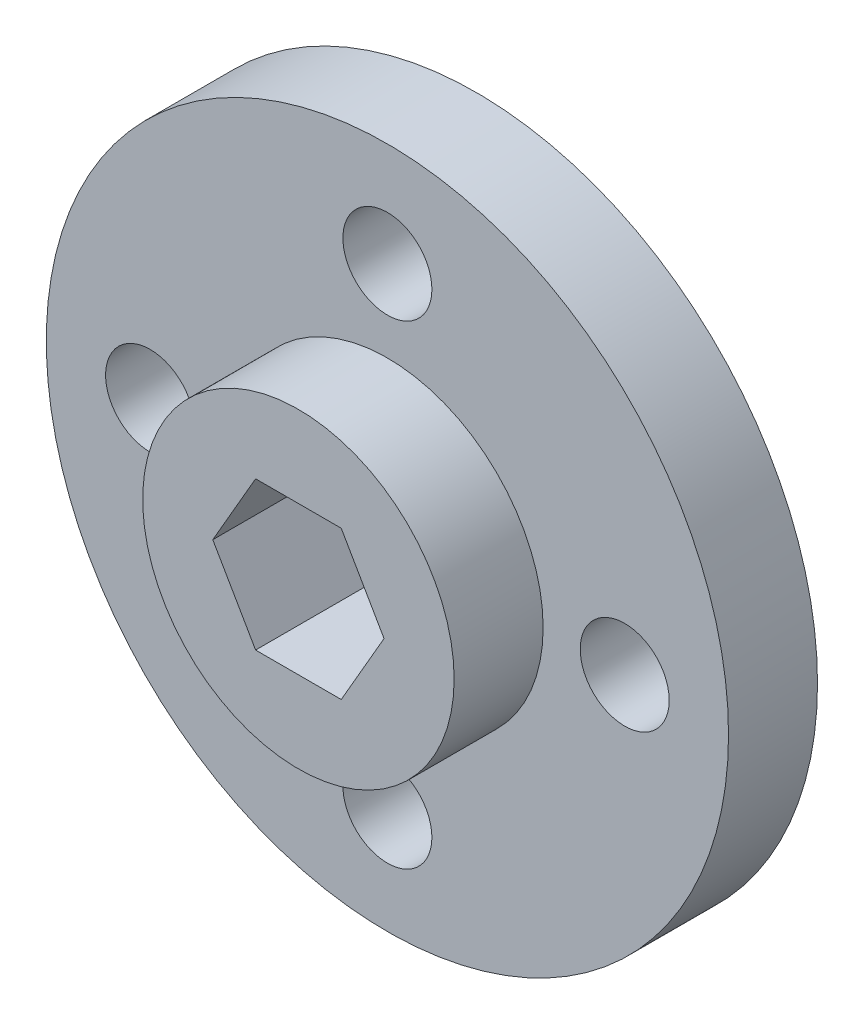
ISO-10303-21;
HEADER;
FILE_DESCRIPTION(('STEP AP214'),'2;1');
FILE_NAME('part.step','',(''),(''),'','','');
FILE_SCHEMA(('AUTOMOTIVE_DESIGN { 1 0 10303 214 1 1 1 1 }'));
ENDSEC;
DATA;
#1=APPLICATION_CONTEXT('core data for automotive mechanical design processes');
#2=APPLICATION_PROTOCOL_DEFINITION('international standard','automotive_design',2000,#1);
#3=PRODUCT_CONTEXT('',#1,'mechanical');
#4=PRODUCT('Part','Part','',(#3));
#5=PRODUCT_RELATED_PRODUCT_CATEGORY('part','',(#4));
#6=PRODUCT_DEFINITION_FORMATION('','',#4);
#7=PRODUCT_DEFINITION_CONTEXT('part definition',#1,'design');
#8=PRODUCT_DEFINITION('design','',#6,#7);
#9=PRODUCT_DEFINITION_SHAPE('','',#8);
#10=(LENGTH_UNIT() NAMED_UNIT(*) SI_UNIT(.MILLI.,.METRE.));
#11=(NAMED_UNIT(*) PLANE_ANGLE_UNIT() SI_UNIT($,.RADIAN.));
#12=(NAMED_UNIT(*) SI_UNIT($,.STERADIAN.) SOLID_ANGLE_UNIT());
#13=UNCERTAINTY_MEASURE_WITH_UNIT(LENGTH_MEASURE(1.E-05),#10,'distance_accuracy_value','');
#14=(GEOMETRIC_REPRESENTATION_CONTEXT(3) GLOBAL_UNCERTAINTY_ASSIGNED_CONTEXT((#13)) GLOBAL_UNIT_ASSIGNED_CONTEXT((#10,
#11,#12)) REPRESENTATION_CONTEXT('',''));
#15=CARTESIAN_POINT('',(0.,0.,0.));
#16=DIRECTION('',(0.,0.,1.));
#17=DIRECTION('',(1.,0.,0.));
#18=AXIS2_PLACEMENT_3D('',#15,#16,#17);
#19=CARTESIAN_POINT('',(0.,0.,3.));
#20=DIRECTION('',(0.,0.,1.));
#21=DIRECTION('',(1.,0.,0.));
#22=AXIS2_PLACEMENT_3D('',#19,#20,#21);
#23=PLANE('',#22);
#24=CARTESIAN_POINT('',(0.,0.,3.));
#25=DIRECTION('',(0.,0.,1.));
#26=DIRECTION('',(1.,0.,0.));
#27=AXIS2_PLACEMENT_3D('',#24,#25,#26);
#28=CIRCLE('',#27,5.25);
#29=CARTESIAN_POINT('',(5.25,0.,3.));
#30=VERTEX_POINT('',#29);
#31=EDGE_CURVE('E136',#30,#30,#28,.T.);
#32=ORIENTED_EDGE('',*,*,#31,.F.);
#33=EDGE_LOOP('',(#32));
#34=FACE_BOUND('',#33,.T.);
#35=CARTESIAN_POINT('',(2.29241571302247E-13,-7.99999999999977,3.));
#36=DIRECTION('',(0.,0.,1.));
#37=DIRECTION('',(1.,0.,0.));
#38=AXIS2_PLACEMENT_3D('',#35,#36,#37);
#39=CIRCLE('',#38,1.50000000000034);
#40=CARTESIAN_POINT('',(1.50000000000057,-7.99999999999977,3.));
#41=VERTEX_POINT('',#40);
#42=EDGE_CURVE('E154',#41,#41,#39,.T.);
#43=ORIENTED_EDGE('',*,*,#42,.F.);
#44=EDGE_LOOP('',(#43));
#45=FACE_BOUND('',#44,.T.);
#46=CARTESIAN_POINT('',(0.,8.,3.));
#47=DIRECTION('',(0.,0.,1.));
#48=DIRECTION('',(1.,0.,0.));
#49=AXIS2_PLACEMENT_3D('',#46,#47,#48);
#50=CIRCLE('',#49,1.5);
#51=CARTESIAN_POINT('',(1.5,8.,3.));
#52=VERTEX_POINT('',#51);
#53=EDGE_CURVE('E166',#52,#52,#50,.T.);
#54=ORIENTED_EDGE('',*,*,#53,.F.);
#55=EDGE_LOOP('',(#54));
#56=FACE_BOUND('',#55,.T.);
#57=CARTESIAN_POINT('',(0.,0.,3.));
#58=DIRECTION('',(0.,0.,1.));
#59=DIRECTION('',(1.,0.,0.));
#60=AXIS2_PLACEMENT_3D('',#57,#58,#59);
#61=CIRCLE('',#60,11.5);
#62=CARTESIAN_POINT('',(11.5,0.,3.));
#63=VERTEX_POINT('',#62);
#64=EDGE_CURVE('E11',#63,#63,#61,.T.);
#65=ORIENTED_EDGE('',*,*,#64,.T.);
#66=EDGE_LOOP('',(#65));
#67=FACE_BOUND('',#66,.T.);
#68=CARTESIAN_POINT('',(8.00000000000023,2.25904099284255E-13,3.));
#69=DIRECTION('',(0.,0.,1.));
#70=DIRECTION('',(1.,0.,0.));
#71=AXIS2_PLACEMENT_3D('',#68,#69,#70);
#72=CIRCLE('',#71,1.50000000000018);
#73=CARTESIAN_POINT('',(9.5000000000004,2.25904099284255E-13,3.));
#74=VERTEX_POINT('',#73);
#75=EDGE_CURVE('E160',#74,#74,#72,.T.);
#76=ORIENTED_EDGE('',*,*,#75,.F.);
#77=EDGE_LOOP('',(#76));
#78=FACE_BOUND('',#77,.T.);
#79=CARTESIAN_POINT('',(-7.99999999999977,-2.26883816723573E-13,3.));
#80=DIRECTION('',(0.,0.,1.));
#81=DIRECTION('',(1.,0.,0.));
#82=AXIS2_PLACEMENT_3D('',#79,#80,#81);
#83=CIRCLE('',#82,1.50000000000036);
#84=CARTESIAN_POINT('',(-6.49999999999941,-2.26883816723573E-13,3.));
#85=VERTEX_POINT('',#84);
#86=EDGE_CURVE('E148',#85,#85,#83,.T.);
#87=ORIENTED_EDGE('',*,*,#86,.F.);
#88=EDGE_LOOP('',(#87));
#89=FACE_BOUND('',#88,.T.);
#90=ADVANCED_FACE('F33',(#34,#45,#56,#67,#78,#89),#23,.T.);
#91=CARTESIAN_POINT('',(0.,0.,0.));
#92=DIRECTION('',(0.,0.,1.));
#93=DIRECTION('',(1.,0.,0.));
#94=AXIS2_PLACEMENT_3D('',#91,#92,#93);
#95=PLANE('',#94);
#96=CARTESIAN_POINT('',(0.,0.,0.));
#97=DIRECTION('',(0.,0.,1.));
#98=DIRECTION('',(1.,0.,0.));
#99=AXIS2_PLACEMENT_3D('',#96,#97,#98);
#100=CIRCLE('',#99,1.65);
#101=CARTESIAN_POINT('',(1.65,0.,0.));
#102=VERTEX_POINT('',#101);
#103=EDGE_CURVE('E123',#102,#102,#100,.F.);
#104=ORIENTED_EDGE('',*,*,#103,.F.);
#105=EDGE_LOOP('',(#104));
#106=FACE_BOUND('',#105,.T.);
#107=CARTESIAN_POINT('',(0.,0.,0.));
#108=DIRECTION('',(0.,0.,1.));
#109=DIRECTION('',(1.,0.,0.));
#110=AXIS2_PLACEMENT_3D('',#107,#108,#109);
#111=CIRCLE('',#110,11.5);
#112=CARTESIAN_POINT('',(11.5,0.,0.));
#113=VERTEX_POINT('',#112);
#114=EDGE_CURVE('E37',#113,#113,#111,.T.);
#115=ORIENTED_EDGE('',*,*,#114,.F.);
#116=EDGE_LOOP('',(#115));
#117=FACE_BOUND('',#116,.T.);
#118=CARTESIAN_POINT('',(0.,8.,0.));
#119=DIRECTION('',(0.,0.,1.));
#120=DIRECTION('',(1.,0.,0.));
#121=AXIS2_PLACEMENT_3D('',#118,#119,#120);
#122=CIRCLE('',#121,1.5);
#123=CARTESIAN_POINT('',(1.5,8.,0.));
#124=VERTEX_POINT('',#123);
#125=EDGE_CURVE('E163',#124,#124,#122,.T.);
#126=ORIENTED_EDGE('',*,*,#125,.T.);
#127=EDGE_LOOP('',(#126));
#128=FACE_BOUND('',#127,.T.);
#129=CARTESIAN_POINT('',(8.00000000000023,2.25904099284255E-13,0.));
#130=DIRECTION('',(0.,0.,1.));
#131=DIRECTION('',(1.,0.,0.));
#132=AXIS2_PLACEMENT_3D('',#129,#130,#131);
#133=CIRCLE('',#132,1.50000000000018);
#134=CARTESIAN_POINT('',(9.5000000000004,2.25904099284255E-13,0.));
#135=VERTEX_POINT('',#134);
#136=EDGE_CURVE('E157',#135,#135,#133,.T.);
#137=ORIENTED_EDGE('',*,*,#136,.T.);
#138=EDGE_LOOP('',(#137));
#139=FACE_BOUND('',#138,.T.);
#140=CARTESIAN_POINT('',(2.29241571302247E-13,-7.99999999999977,0.));
#141=DIRECTION('',(0.,0.,1.));
#142=DIRECTION('',(1.,0.,0.));
#143=AXIS2_PLACEMENT_3D('',#140,#141,#142);
#144=CIRCLE('',#143,1.50000000000034);
#145=CARTESIAN_POINT('',(1.50000000000057,-7.99999999999977,0.));
#146=VERTEX_POINT('',#145);
#147=EDGE_CURVE('E151',#146,#146,#144,.T.);
#148=ORIENTED_EDGE('',*,*,#147,.T.);
#149=EDGE_LOOP('',(#148));
#150=FACE_BOUND('',#149,.T.);
#151=CARTESIAN_POINT('',(-7.99999999999977,-2.26883816723573E-13,0.));
#152=DIRECTION('',(0.,0.,1.));
#153=DIRECTION('',(1.,0.,0.));
#154=AXIS2_PLACEMENT_3D('',#151,#152,#153);
#155=CIRCLE('',#154,1.50000000000036);
#156=CARTESIAN_POINT('',(-6.49999999999941,-2.26883816723573E-13,0.));
#157=VERTEX_POINT('',#156);
#158=EDGE_CURVE('E145',#157,#157,#155,.T.);
#159=ORIENTED_EDGE('',*,*,#158,.T.);
#160=EDGE_LOOP('',(#159));
#161=FACE_BOUND('',#160,.T.);
#162=ADVANCED_FACE('F172',(#106,#117,#128,#139,#150,#161),#95,.F.);
#163=CARTESIAN_POINT('',(0.,0.,3.));
#164=DIRECTION('',(0.,0.,-1.));
#165=DIRECTION('',(-1.,0.,0.));
#166=AXIS2_PLACEMENT_3D('',#163,#164,#165);
#167=CYLINDRICAL_SURFACE('',#166,11.5);
#168=ORIENTED_EDGE('',*,*,#64,.F.);
#169=EDGE_LOOP('',(#168));
#170=FACE_BOUND('',#169,.T.);
#171=ORIENTED_EDGE('',*,*,#114,.T.);
#172=EDGE_LOOP('',(#171));
#173=FACE_BOUND('',#172,.T.);
#174=ADVANCED_FACE('F35',(#170,#173),#167,.T.);
#175=CARTESIAN_POINT('',(0.,8.,3.));
#176=DIRECTION('',(0.,0.,-1.));
#177=DIRECTION('',(-1.,0.,0.));
#178=AXIS2_PLACEMENT_3D('',#175,#176,#177);
#179=CYLINDRICAL_SURFACE('',#178,1.5);
#180=ORIENTED_EDGE('',*,*,#53,.T.);
#181=EDGE_LOOP('',(#180));
#182=FACE_BOUND('',#181,.T.);
#183=ORIENTED_EDGE('',*,*,#125,.F.);
#184=EDGE_LOOP('',(#183));
#185=FACE_BOUND('',#184,.T.);
#186=ADVANCED_FACE('F175',(#182,#185),#179,.F.);
#187=CARTESIAN_POINT('',(8.00000000000023,2.25904099284255E-13,3.));
#188=DIRECTION('',(0.,0.,-1.));
#189=DIRECTION('',(-1.,0.,0.));
#190=AXIS2_PLACEMENT_3D('',#187,#188,#189);
#191=CYLINDRICAL_SURFACE('',#190,1.50000000000018);
#192=ORIENTED_EDGE('',*,*,#75,.T.);
#193=EDGE_LOOP('',(#192));
#194=FACE_BOUND('',#193,.T.);
#195=ORIENTED_EDGE('',*,*,#136,.F.);
#196=EDGE_LOOP('',(#195));
#197=FACE_BOUND('',#196,.T.);
#198=ADVANCED_FACE('F177',(#194,#197),#191,.F.);
#199=CARTESIAN_POINT('',(2.29241571302247E-13,-7.99999999999977,3.));
#200=DIRECTION('',(0.,0.,-1.));
#201=DIRECTION('',(-1.,0.,0.));
#202=AXIS2_PLACEMENT_3D('',#199,#200,#201);
#203=CYLINDRICAL_SURFACE('',#202,1.50000000000034);
#204=ORIENTED_EDGE('',*,*,#42,.T.);
#205=EDGE_LOOP('',(#204));
#206=FACE_BOUND('',#205,.T.);
#207=ORIENTED_EDGE('',*,*,#147,.F.);
#208=EDGE_LOOP('',(#207));
#209=FACE_BOUND('',#208,.T.);
#210=ADVANCED_FACE('F184',(#206,#209),#203,.F.);
#211=CARTESIAN_POINT('',(-7.99999999999977,-2.26883816723573E-13,3.));
#212=DIRECTION('',(0.,0.,-1.));
#213=DIRECTION('',(-1.,0.,0.));
#214=AXIS2_PLACEMENT_3D('',#211,#212,#213);
#215=CYLINDRICAL_SURFACE('',#214,1.50000000000036);
#216=ORIENTED_EDGE('',*,*,#86,.T.);
#217=EDGE_LOOP('',(#216));
#218=FACE_BOUND('',#217,.T.);
#219=ORIENTED_EDGE('',*,*,#158,.F.);
#220=EDGE_LOOP('',(#219));
#221=FACE_BOUND('',#220,.T.);
#222=ADVANCED_FACE('F207',(#218,#221),#215,.F.);
#223=CARTESIAN_POINT('',(0.,0.,6.));
#224=DIRECTION('',(0.,0.,-1.));
#225=DIRECTION('',(-1.,0.,0.));
#226=AXIS2_PLACEMENT_3D('',#223,#224,#225);
#227=CYLINDRICAL_SURFACE('',#226,5.25);
#228=CARTESIAN_POINT('',(0.,0.,6.));
#229=DIRECTION('',(0.,0.,1.));
#230=DIRECTION('',(1.,0.,0.));
#231=AXIS2_PLACEMENT_3D('',#228,#229,#230);
#232=CIRCLE('',#231,5.25);
#233=CARTESIAN_POINT('',(5.25,0.,6.));
#234=VERTEX_POINT('',#233);
#235=EDGE_CURVE('E142',#234,#234,#232,.T.);
#236=ORIENTED_EDGE('',*,*,#235,.F.);
#237=EDGE_LOOP('',(#236));
#238=FACE_BOUND('',#237,.T.);
#239=ORIENTED_EDGE('',*,*,#31,.T.);
#240=EDGE_LOOP('',(#239));
#241=FACE_BOUND('',#240,.T.);
#242=ADVANCED_FACE('F210',(#238,#241),#227,.T.);
#243=CARTESIAN_POINT('',(0.,0.,6.));
#244=DIRECTION('',(0.,0.,1.));
#245=DIRECTION('',(1.,0.,0.));
#246=AXIS2_PLACEMENT_3D('',#243,#244,#245);
#247=PLANE('',#246);
#248=DIRECTION('',(0.5,0.866025403784439,0.));
#249=VECTOR('',#248,1.);
#250=CARTESIAN_POINT('',(1.44337567297407,-2.5,6.));
#251=LINE('',#250,#249);
#252=CARTESIAN_POINT('',(1.44337567297407,-2.5,6.));
#253=VERTEX_POINT('',#252);
#254=CARTESIAN_POINT('',(2.88675134594813,0.,6.));
#255=VERTEX_POINT('',#254);
#256=EDGE_CURVE('E48',#253,#255,#251,.T.);
#257=ORIENTED_EDGE('',*,*,#256,.F.);
#258=DIRECTION('',(1.,0.,0.));
#259=VECTOR('',#258,1.);
#260=CARTESIAN_POINT('',(-1.44337567297406,-2.5,6.));
#261=LINE('',#260,#259);
#262=CARTESIAN_POINT('',(-1.44337567297406,-2.5,6.));
#263=VERTEX_POINT('',#262);
#264=EDGE_CURVE('E132',#263,#253,#261,.T.);
#265=ORIENTED_EDGE('',*,*,#264,.F.);
#266=DIRECTION('',(0.5,-0.866025403784438,0.));
#267=VECTOR('',#266,1.);
#268=CARTESIAN_POINT('',(-2.88675134594813,0.,6.));
#269=LINE('',#268,#267);
#270=CARTESIAN_POINT('',(-2.88675134594813,0.,6.));
#271=VERTEX_POINT('',#270);
#272=EDGE_CURVE('E130',#271,#263,#269,.T.);
#273=ORIENTED_EDGE('',*,*,#272,.F.);
#274=DIRECTION('',(-0.5,-0.866025403784439,0.));
#275=VECTOR('',#274,1.);
#276=CARTESIAN_POINT('',(-1.44337567297406,2.5,6.));
#277=LINE('',#276,#275);
#278=CARTESIAN_POINT('',(-1.44337567297406,2.5,6.));
#279=VERTEX_POINT('',#278);
#280=EDGE_CURVE('E96',#279,#271,#277,.T.);
#281=ORIENTED_EDGE('',*,*,#280,.F.);
#282=DIRECTION('',(-1.,0.,0.));
#283=VECTOR('',#282,1.);
#284=CARTESIAN_POINT('',(1.44337567297406,2.5,6.));
#285=LINE('',#284,#283);
#286=CARTESIAN_POINT('',(1.44337567297406,2.5,6.));
#287=VERTEX_POINT('',#286);
#288=EDGE_CURVE('E126',#287,#279,#285,.T.);
#289=ORIENTED_EDGE('',*,*,#288,.F.);
#290=DIRECTION('',(-0.500000000000001,0.866025403784438,0.));
#291=VECTOR('',#290,1.);
#292=CARTESIAN_POINT('',(2.88675134594813,0.,6.));
#293=LINE('',#292,#291);
#294=EDGE_CURVE('E122',#255,#287,#293,.T.);
#295=ORIENTED_EDGE('',*,*,#294,.F.);
#296=EDGE_LOOP('',(#257,#265,#273,#281,#289,#295));
#297=FACE_BOUND('',#296,.T.);
#298=ORIENTED_EDGE('',*,*,#235,.T.);
#299=EDGE_LOOP('',(#298));
#300=FACE_BOUND('',#299,.T.);
#301=ADVANCED_FACE('F218',(#297,#300),#247,.T.);
#302=CARTESIAN_POINT('',(1.44337567297407,-2.5,1.5));
#303=DIRECTION('',(0.866025403784439,-0.5,0.));
#304=DIRECTION('',(0.5,0.866025403784439,0.));
#305=AXIS2_PLACEMENT_3D('',#302,#303,#304);
#306=PLANE('',#305);
#307=ORIENTED_EDGE('',*,*,#256,.T.);
#308=DIRECTION('',(0.,0.,1.));
#309=VECTOR('',#308,1.);
#310=CARTESIAN_POINT('',(2.88675134594813,0.,1.5));
#311=LINE('',#310,#309);
#312=CARTESIAN_POINT('',(2.88675134594813,0.,1.5));
#313=VERTEX_POINT('',#312);
#314=EDGE_CURVE('E78',#313,#255,#311,.T.);
#315=ORIENTED_EDGE('',*,*,#314,.F.);
#316=DIRECTION('',(0.5,0.866025403784439,0.));
#317=VECTOR('',#316,1.);
#318=CARTESIAN_POINT('',(1.44337567297407,-2.5,1.5));
#319=LINE('',#318,#317);
#320=CARTESIAN_POINT('',(1.44337567297407,-2.5,1.5));
#321=VERTEX_POINT('',#320);
#322=EDGE_CURVE('E134',#321,#313,#319,.T.);
#323=ORIENTED_EDGE('',*,*,#322,.F.);
#324=DIRECTION('',(0.,0.,1.));
#325=VECTOR('',#324,1.);
#326=CARTESIAN_POINT('',(1.44337567297407,-2.5,1.5));
#327=LINE('',#326,#325);
#328=EDGE_CURVE('E56',#321,#253,#327,.T.);
#329=ORIENTED_EDGE('',*,*,#328,.T.);
#330=EDGE_LOOP('',(#307,#315,#323,#329));
#331=FACE_BOUND('',#330,.T.);
#332=ADVANCED_FACE('F226',(#331),#306,.F.);
#333=CARTESIAN_POINT('',(-1.44337567297406,-2.5,1.5));
#334=DIRECTION('',(0.,-1.,0.));
#335=DIRECTION('',(1.,0.,0.));
#336=AXIS2_PLACEMENT_3D('',#333,#334,#335);
#337=PLANE('',#336);
#338=ORIENTED_EDGE('',*,*,#264,.T.);
#339=ORIENTED_EDGE('',*,*,#328,.F.);
#340=DIRECTION('',(1.,0.,0.));
#341=VECTOR('',#340,1.);
#342=CARTESIAN_POINT('',(-1.44337567297406,-2.5,1.5));
#343=LINE('',#342,#341);
#344=CARTESIAN_POINT('',(-1.44337567297406,-2.5,1.5));
#345=VERTEX_POINT('',#344);
#346=EDGE_CURVE('E108',#345,#321,#343,.T.);
#347=ORIENTED_EDGE('',*,*,#346,.F.);
#348=DIRECTION('',(0.,0.,1.));
#349=VECTOR('',#348,1.);
#350=CARTESIAN_POINT('',(-1.44337567297406,-2.5,1.5));
#351=LINE('',#350,#349);
#352=EDGE_CURVE('E100',#345,#263,#351,.T.);
#353=ORIENTED_EDGE('',*,*,#352,.T.);
#354=EDGE_LOOP('',(#338,#339,#347,#353));
#355=FACE_BOUND('',#354,.T.);
#356=ADVANCED_FACE('F230',(#355),#337,.F.);
#357=CARTESIAN_POINT('',(-2.88675134594813,0.,1.5));
#358=DIRECTION('',(-0.866025403784438,-0.5,0.));
#359=DIRECTION('',(0.5,-0.866025403784439,0.));
#360=AXIS2_PLACEMENT_3D('',#357,#358,#359);
#361=PLANE('',#360);
#362=ORIENTED_EDGE('',*,*,#272,.T.);
#363=ORIENTED_EDGE('',*,*,#352,.F.);
#364=DIRECTION('',(0.5,-0.866025403784438,0.));
#365=VECTOR('',#364,1.);
#366=CARTESIAN_POINT('',(-2.88675134594813,0.,1.5));
#367=LINE('',#366,#365);
#368=CARTESIAN_POINT('',(-2.88675134594813,0.,1.5));
#369=VERTEX_POINT('',#368);
#370=EDGE_CURVE('E104',#369,#345,#367,.T.);
#371=ORIENTED_EDGE('',*,*,#370,.F.);
#372=DIRECTION('',(0.,0.,1.));
#373=VECTOR('',#372,1.);
#374=CARTESIAN_POINT('',(-2.88675134594813,0.,1.5));
#375=LINE('',#374,#373);
#376=EDGE_CURVE('E89',#369,#271,#375,.T.);
#377=ORIENTED_EDGE('',*,*,#376,.T.);
#378=EDGE_LOOP('',(#362,#363,#371,#377));
#379=FACE_BOUND('',#378,.T.);
#380=ADVANCED_FACE('F105',(#379),#361,.F.);
#381=CARTESIAN_POINT('',(-1.44337567297406,2.5,1.5));
#382=DIRECTION('',(-0.866025403784438,0.5,0.));
#383=DIRECTION('',(-0.5,-0.866025403784439,0.));
#384=AXIS2_PLACEMENT_3D('',#381,#382,#383);
#385=PLANE('',#384);
#386=ORIENTED_EDGE('',*,*,#280,.T.);
#387=ORIENTED_EDGE('',*,*,#376,.F.);
#388=DIRECTION('',(-0.5,-0.866025403784439,0.));
#389=VECTOR('',#388,1.);
#390=CARTESIAN_POINT('',(-1.44337567297406,2.5,1.5));
#391=LINE('',#390,#389);
#392=CARTESIAN_POINT('',(-1.44337567297406,2.5,1.5));
#393=VERTEX_POINT('',#392);
#394=EDGE_CURVE('E93',#393,#369,#391,.T.);
#395=ORIENTED_EDGE('',*,*,#394,.F.);
#396=DIRECTION('',(0.,0.,1.));
#397=VECTOR('',#396,1.);
#398=CARTESIAN_POINT('',(-1.44337567297406,2.5,1.5));
#399=LINE('',#398,#397);
#400=EDGE_CURVE('E101',#393,#279,#399,.T.);
#401=ORIENTED_EDGE('',*,*,#400,.T.);
#402=EDGE_LOOP('',(#386,#387,#395,#401));
#403=FACE_BOUND('',#402,.T.);
#404=ADVANCED_FACE('F91',(#403),#385,.F.);
#405=CARTESIAN_POINT('',(1.44337567297406,2.5,1.5));
#406=DIRECTION('',(0.,1.,0.));
#407=DIRECTION('',(-1.,0.,0.));
#408=AXIS2_PLACEMENT_3D('',#405,#406,#407);
#409=PLANE('',#408);
#410=ORIENTED_EDGE('',*,*,#288,.T.);
#411=ORIENTED_EDGE('',*,*,#400,.F.);
#412=DIRECTION('',(-1.,0.,0.));
#413=VECTOR('',#412,1.);
#414=CARTESIAN_POINT('',(1.44337567297406,2.5,1.5));
#415=LINE('',#414,#413);
#416=CARTESIAN_POINT('',(1.44337567297406,2.5,1.5));
#417=VERTEX_POINT('',#416);
#418=EDGE_CURVE('E114',#417,#393,#415,.T.);
#419=ORIENTED_EDGE('',*,*,#418,.F.);
#420=DIRECTION('',(0.,0.,1.));
#421=VECTOR('',#420,1.);
#422=CARTESIAN_POINT('',(1.44337567297406,2.5,1.5));
#423=LINE('',#422,#421);
#424=EDGE_CURVE('E139',#417,#287,#423,.T.);
#425=ORIENTED_EDGE('',*,*,#424,.T.);
#426=EDGE_LOOP('',(#410,#411,#419,#425));
#427=FACE_BOUND('',#426,.T.);
#428=ADVANCED_FACE('F234',(#427),#409,.F.);
#429=CARTESIAN_POINT('',(2.88675134594813,0.,1.5));
#430=DIRECTION('',(0.866025403784438,0.500000000000001,0.));
#431=DIRECTION('',(-0.500000000000001,0.866025403784438,0.));
#432=AXIS2_PLACEMENT_3D('',#429,#430,#431);
#433=PLANE('',#432);
#434=ORIENTED_EDGE('',*,*,#294,.T.);
#435=ORIENTED_EDGE('',*,*,#424,.F.);
#436=DIRECTION('',(-0.500000000000001,0.866025403784438,0.));
#437=VECTOR('',#436,1.);
#438=CARTESIAN_POINT('',(2.88675134594813,0.,1.5));
#439=LINE('',#438,#437);
#440=EDGE_CURVE('E116',#313,#417,#439,.T.);
#441=ORIENTED_EDGE('',*,*,#440,.F.);
#442=ORIENTED_EDGE('',*,*,#314,.T.);
#443=EDGE_LOOP('',(#434,#435,#441,#442));
#444=FACE_BOUND('',#443,.T.);
#445=ADVANCED_FACE('F231',(#444),#433,.F.);
#446=CARTESIAN_POINT('',(0.,0.,1.5));
#447=DIRECTION('',(0.,0.,1.));
#448=DIRECTION('',(1.,0.,0.));
#449=AXIS2_PLACEMENT_3D('',#446,#447,#448);
#450=PLANE('',#449);
#451=CARTESIAN_POINT('',(0.,0.,1.5));
#452=DIRECTION('',(0.,0.,1.));
#453=DIRECTION('',(1.,0.,0.));
#454=AXIS2_PLACEMENT_3D('',#451,#452,#453);
#455=CIRCLE('',#454,1.65);
#456=CARTESIAN_POINT('',(1.65,0.,1.5));
#457=VERTEX_POINT('',#456);
#458=EDGE_CURVE('E256',#457,#457,#455,.T.);
#459=ORIENTED_EDGE('',*,*,#458,.F.);
#460=EDGE_LOOP('',(#459));
#461=FACE_BOUND('',#460,.T.);
#462=ORIENTED_EDGE('',*,*,#322,.T.);
#463=ORIENTED_EDGE('',*,*,#440,.T.);
#464=ORIENTED_EDGE('',*,*,#418,.T.);
#465=ORIENTED_EDGE('',*,*,#394,.T.);
#466=ORIENTED_EDGE('',*,*,#370,.T.);
#467=ORIENTED_EDGE('',*,*,#346,.T.);
#468=EDGE_LOOP('',(#462,#463,#464,#465,#466,#467));
#469=FACE_BOUND('',#468,.T.);
#470=ADVANCED_FACE('F111',(#461,#469),#450,.T.);
#471=CARTESIAN_POINT('',(0.,0.,-0.000999999999999916));
#472=DIRECTION('',(0.,0.,1.));
#473=DIRECTION('',(1.,0.,0.));
#474=AXIS2_PLACEMENT_3D('',#471,#472,#473);
#475=CYLINDRICAL_SURFACE('',#474,1.65);
#476=ORIENTED_EDGE('',*,*,#458,.T.);
#477=EDGE_LOOP('',(#476));
#478=FACE_BOUND('',#477,.T.);
#479=ORIENTED_EDGE('',*,*,#103,.T.);
#480=EDGE_LOOP('',(#479));
#481=FACE_BOUND('',#480,.T.);
#482=ADVANCED_FACE('F247',(#478,#481),#475,.F.);
#483=CLOSED_SHELL('',(#90,#162,#174,#186,#198,#210,#222,#242,#301,#332,#356,#380,#404,#428,#445,
#470,#482));
#484=MANIFOLD_SOLID_BREP('B2',#483);
#485=ADVANCED_BREP_SHAPE_REPRESENTATION('',(#18,#484),#14);
#486=SHAPE_DEFINITION_REPRESENTATION(#9,#485);
ENDSEC;
END-ISO-10303-21;
